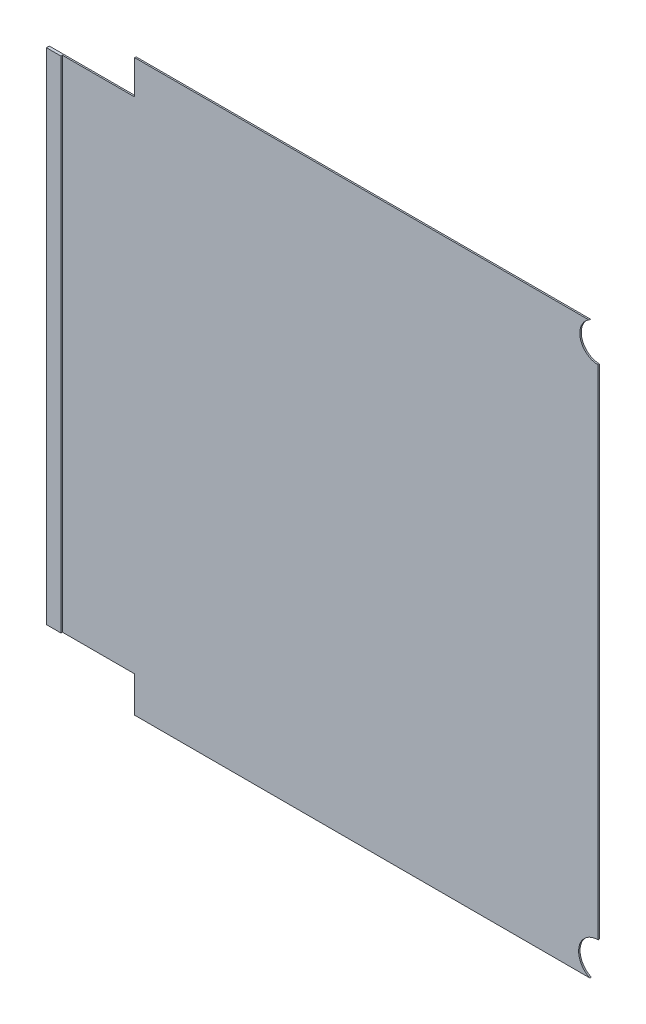
ISO-10303-21;
HEADER;
FILE_DESCRIPTION(('STEP AP214'),'2;1');
FILE_NAME('part.step','',(''),(''),'','','');
FILE_SCHEMA(('AUTOMOTIVE_DESIGN { 1 0 10303 214 1 1 1 1 }'));
ENDSEC;
DATA;
#1=APPLICATION_CONTEXT('core data for automotive mechanical design processes');
#2=APPLICATION_PROTOCOL_DEFINITION('international standard','automotive_design',2000,#1);
#3=PRODUCT_CONTEXT('',#1,'mechanical');
#4=PRODUCT('Part','Part','',(#3));
#5=PRODUCT_RELATED_PRODUCT_CATEGORY('part','',(#4));
#6=PRODUCT_DEFINITION_FORMATION('','',#4);
#7=PRODUCT_DEFINITION_CONTEXT('part definition',#1,'design');
#8=PRODUCT_DEFINITION('design','',#6,#7);
#9=PRODUCT_DEFINITION_SHAPE('','',#8);
#10=(LENGTH_UNIT() NAMED_UNIT(*) SI_UNIT(.MILLI.,.METRE.));
#11=(NAMED_UNIT(*) PLANE_ANGLE_UNIT() SI_UNIT($,.RADIAN.));
#12=(NAMED_UNIT(*) SI_UNIT($,.STERADIAN.) SOLID_ANGLE_UNIT());
#13=UNCERTAINTY_MEASURE_WITH_UNIT(LENGTH_MEASURE(1.E-05),#10,'distance_accuracy_value','');
#14=(GEOMETRIC_REPRESENTATION_CONTEXT(3) GLOBAL_UNCERTAINTY_ASSIGNED_CONTEXT((#13)) GLOBAL_UNIT_ASSIGNED_CONTEXT((#10,
#11,#12)) REPRESENTATION_CONTEXT('',''));
#15=CARTESIAN_POINT('',(0.,0.,0.));
#16=DIRECTION('',(0.,0.,1.));
#17=DIRECTION('',(1.,0.,0.));
#18=AXIS2_PLACEMENT_3D('',#15,#16,#17);
#19=CARTESIAN_POINT('',(-280.000000000001,184.999999999997,1.));
#20=DIRECTION('',(0.,0.,-1.));
#21=DIRECTION('',(-1.,0.,0.));
#22=AXIS2_PLACEMENT_3D('',#19,#20,#21);
#23=CYLINDRICAL_SURFACE('',#22,12.6657479077272);
#24=CARTESIAN_POINT('',(-280.000000000001,184.999999999997,0.));
#25=DIRECTION('',(0.,0.,-1.));
#26=DIRECTION('',(1.,0.,0.));
#27=AXIS2_PLACEMENT_3D('',#24,#25,#26);
#28=CIRCLE('',#27,12.6657479077272);
#29=CARTESIAN_POINT('',(-280.000000000001,172.334252092269,0.));
#30=VERTEX_POINT('',#29);
#31=CARTESIAN_POINT('',(-286.278628039789,196.000000000001,0.));
#32=VERTEX_POINT('',#31);
#33=EDGE_CURVE('E140',#30,#32,#28,.T.);
#34=ORIENTED_EDGE('',*,*,#33,.T.);
#35=DIRECTION('',(0.,0.,-1.));
#36=VECTOR('',#35,1.);
#37=CARTESIAN_POINT('',(-286.278628039789,196.000000000001,1.));
#38=LINE('',#37,#36);
#39=CARTESIAN_POINT('',(-286.278628039789,196.000000000001,1.));
#40=VERTEX_POINT('',#39);
#41=EDGE_CURVE('E11',#40,#32,#38,.T.);
#42=ORIENTED_EDGE('',*,*,#41,.F.);
#43=CARTESIAN_POINT('',(-280.000000000001,184.999999999997,1.));
#44=DIRECTION('',(0.,0.,-1.));
#45=DIRECTION('',(1.,0.,0.));
#46=AXIS2_PLACEMENT_3D('',#43,#44,#45);
#47=CIRCLE('',#46,12.6657479077272);
#48=CARTESIAN_POINT('',(-280.000000000001,172.334252092269,1.));
#49=VERTEX_POINT('',#48);
#50=EDGE_CURVE('E158',#49,#40,#47,.T.);
#51=ORIENTED_EDGE('',*,*,#50,.F.);
#52=DIRECTION('',(0.,0.,-1.));
#53=VECTOR('',#52,1.);
#54=CARTESIAN_POINT('',(-280.000000000001,172.334252092269,1.));
#55=LINE('',#54,#53);
#56=EDGE_CURVE('E136',#49,#30,#55,.T.);
#57=ORIENTED_EDGE('',*,*,#56,.T.);
#58=EDGE_LOOP('',(#34,#42,#51,#57));
#59=FACE_BOUND('',#58,.T.);
#60=ADVANCED_FACE('F38',(#59),#23,.F.);
#61=CARTESIAN_POINT('',(-286.278628039789,196.000000000001,1.));
#62=DIRECTION('',(0.,-1.,0.));
#63=DIRECTION('',(1.,0.,0.));
#64=AXIS2_PLACEMENT_3D('',#61,#62,#63);
#65=PLANE('',#64);
#66=DIRECTION('',(-1.,0.,0.));
#67=VECTOR('',#66,1.);
#68=CARTESIAN_POINT('',(-286.278628039789,196.000000000001,0.));
#69=LINE('',#68,#67);
#70=CARTESIAN_POINT('',(-599.96804262372,196.000000000001,0.));
#71=VERTEX_POINT('',#70);
#72=EDGE_CURVE('E143',#32,#71,#69,.T.);
#73=ORIENTED_EDGE('',*,*,#72,.T.);
#74=DIRECTION('',(0.,0.,-1.));
#75=VECTOR('',#74,1.);
#76=CARTESIAN_POINT('',(-599.96804262372,196.000000000001,1.));
#77=LINE('',#76,#75);
#78=CARTESIAN_POINT('',(-599.96804262372,196.000000000001,1.));
#79=VERTEX_POINT('',#78);
#80=EDGE_CURVE('E46',#79,#71,#77,.T.);
#81=ORIENTED_EDGE('',*,*,#80,.F.);
#82=DIRECTION('',(-1.,0.,0.));
#83=VECTOR('',#82,1.);
#84=CARTESIAN_POINT('',(-286.278628039789,196.000000000001,1.));
#85=LINE('',#84,#83);
#86=EDGE_CURVE('E98',#40,#79,#85,.T.);
#87=ORIENTED_EDGE('',*,*,#86,.F.);
#88=ORIENTED_EDGE('',*,*,#41,.T.);
#89=EDGE_LOOP('',(#73,#81,#87,#88));
#90=FACE_BOUND('',#89,.T.);
#91=ADVANCED_FACE('F244',(#90),#65,.F.);
#92=CARTESIAN_POINT('',(-599.96804262372,196.000000000001,1.));
#93=DIRECTION('',(1.,0.,0.));
#94=DIRECTION('',(0.,0.,-1.));
#95=AXIS2_PLACEMENT_3D('',#92,#93,#94);
#96=PLANE('',#95);
#97=DIRECTION('',(0.,-1.,0.));
#98=VECTOR('',#97,1.);
#99=CARTESIAN_POINT('',(-599.96804262372,196.000000000001,0.));
#100=LINE('',#99,#98);
#101=CARTESIAN_POINT('',(-599.96804262372,172.499999999993,0.));
#102=VERTEX_POINT('',#101);
#103=EDGE_CURVE('E146',#71,#102,#100,.T.);
#104=ORIENTED_EDGE('',*,*,#103,.T.);
#105=DIRECTION('',(0.,0.,-1.));
#106=VECTOR('',#105,1.);
#107=CARTESIAN_POINT('',(-599.96804262372,172.499999999993,1.));
#108=LINE('',#107,#106);
#109=CARTESIAN_POINT('',(-599.96804262372,172.499999999993,1.));
#110=VERTEX_POINT('',#109);
#111=EDGE_CURVE('E165',#110,#102,#108,.T.);
#112=ORIENTED_EDGE('',*,*,#111,.F.);
#113=DIRECTION('',(0.,-1.,0.));
#114=VECTOR('',#113,1.);
#115=CARTESIAN_POINT('',(-599.96804262372,196.000000000001,1.));
#116=LINE('',#115,#114);
#117=EDGE_CURVE('E173',#79,#110,#116,.T.);
#118=ORIENTED_EDGE('',*,*,#117,.F.);
#119=ORIENTED_EDGE('',*,*,#80,.T.);
#120=EDGE_LOOP('',(#104,#112,#118,#119));
#121=FACE_BOUND('',#120,.T.);
#122=ADVANCED_FACE('F171',(#121),#96,.F.);
#123=CARTESIAN_POINT('',(-649.96804262372,172.499999999995,1.));
#124=DIRECTION('',(0.,-1.,0.));
#125=DIRECTION('',(1.,0.,0.));
#126=AXIS2_PLACEMENT_3D('',#123,#124,#125);
#127=PLANE('',#126);
#128=DIRECTION('',(-1.,0.,0.));
#129=VECTOR('',#128,1.);
#130=CARTESIAN_POINT('',(-649.96804262372,172.499999999995,0.));
#131=LINE('',#130,#129);
#132=CARTESIAN_POINT('',(-659.96804262372,172.499999999995,0.));
#133=VERTEX_POINT('',#132);
#134=EDGE_CURVE('E148',#102,#133,#131,.T.);
#135=ORIENTED_EDGE('',*,*,#134,.T.);
#136=DIRECTION('',(0.,0.,-1.));
#137=VECTOR('',#136,1.);
#138=CARTESIAN_POINT('',(-659.96804262372,172.499999999995,2.));
#139=LINE('',#138,#137);
#140=CARTESIAN_POINT('',(-659.96804262372,172.499999999995,2.));
#141=VERTEX_POINT('',#140);
#142=EDGE_CURVE('E189',#141,#133,#139,.T.);
#143=ORIENTED_EDGE('',*,*,#142,.F.);
#144=DIRECTION('',(1.,0.,0.));
#145=VECTOR('',#144,1.);
#146=CARTESIAN_POINT('',(-649.96804262372,172.499999999995,2.));
#147=LINE('',#146,#145);
#148=CARTESIAN_POINT('',(-649.96804262372,172.499999999995,2.));
#149=VERTEX_POINT('',#148);
#150=EDGE_CURVE('E210',#141,#149,#147,.T.);
#151=ORIENTED_EDGE('',*,*,#150,.T.);
#152=DIRECTION('',(0.,0.,-1.));
#153=VECTOR('',#152,1.);
#154=CARTESIAN_POINT('',(-649.96804262372,172.499999999995,2.));
#155=LINE('',#154,#153);
#156=CARTESIAN_POINT('',(-649.96804262372,172.499999999995,1.));
#157=VERTEX_POINT('',#156);
#158=EDGE_CURVE('E144',#149,#157,#155,.T.);
#159=ORIENTED_EDGE('',*,*,#158,.T.);
#160=DIRECTION('',(-1.,0.,0.));
#161=VECTOR('',#160,1.);
#162=CARTESIAN_POINT('',(-649.96804262372,172.499999999995,1.));
#163=LINE('',#162,#161);
#164=EDGE_CURVE('E214',#110,#157,#163,.T.);
#165=ORIENTED_EDGE('',*,*,#164,.F.);
#166=ORIENTED_EDGE('',*,*,#111,.T.);
#167=EDGE_LOOP('',(#135,#143,#151,#159,#165,#166));
#168=FACE_BOUND('',#167,.T.);
#169=ADVANCED_FACE('F186',(#168),#127,.F.);
#170=CARTESIAN_POINT('',(-649.96804262372,-172.500000000004,1.));
#171=DIRECTION('',(0.,1.,0.));
#172=DIRECTION('',(-1.,0.,0.));
#173=AXIS2_PLACEMENT_3D('',#170,#171,#172);
#174=PLANE('',#173);
#175=DIRECTION('',(1.,0.,0.));
#176=VECTOR('',#175,1.);
#177=CARTESIAN_POINT('',(-649.96804262372,-172.500000000004,0.));
#178=LINE('',#177,#176);
#179=CARTESIAN_POINT('',(-659.96804262372,-172.500000000004,0.));
#180=VERTEX_POINT('',#179);
#181=CARTESIAN_POINT('',(-599.96804262372,-172.500000000002,0.));
#182=VERTEX_POINT('',#181);
#183=EDGE_CURVE('E151',#180,#182,#178,.T.);
#184=ORIENTED_EDGE('',*,*,#183,.T.);
#185=DIRECTION('',(0.,0.,-1.));
#186=VECTOR('',#185,1.);
#187=CARTESIAN_POINT('',(-599.96804262372,-172.500000000002,1.));
#188=LINE('',#187,#186);
#189=CARTESIAN_POINT('',(-599.96804262372,-172.500000000002,1.));
#190=VERTEX_POINT('',#189);
#191=EDGE_CURVE('E162',#190,#182,#188,.T.);
#192=ORIENTED_EDGE('',*,*,#191,.F.);
#193=DIRECTION('',(1.,0.,0.));
#194=VECTOR('',#193,1.);
#195=CARTESIAN_POINT('',(-649.96804262372,-172.500000000004,1.));
#196=LINE('',#195,#194);
#197=CARTESIAN_POINT('',(-649.96804262372,-172.500000000004,1.));
#198=VERTEX_POINT('',#197);
#199=EDGE_CURVE('E220',#198,#190,#196,.T.);
#200=ORIENTED_EDGE('',*,*,#199,.F.);
#201=DIRECTION('',(0.,0.,-1.));
#202=VECTOR('',#201,1.);
#203=CARTESIAN_POINT('',(-649.96804262372,-172.500000000004,2.));
#204=LINE('',#203,#202);
#205=CARTESIAN_POINT('',(-649.96804262372,-172.500000000004,2.));
#206=VERTEX_POINT('',#205);
#207=EDGE_CURVE('E205',#206,#198,#204,.T.);
#208=ORIENTED_EDGE('',*,*,#207,.F.);
#209=DIRECTION('',(-1.,0.,0.));
#210=VECTOR('',#209,1.);
#211=CARTESIAN_POINT('',(-649.96804262372,-172.500000000004,2.));
#212=LINE('',#211,#210);
#213=CARTESIAN_POINT('',(-659.96804262372,-172.500000000004,2.));
#214=VERTEX_POINT('',#213);
#215=EDGE_CURVE('E338',#206,#214,#212,.T.);
#216=ORIENTED_EDGE('',*,*,#215,.T.);
#217=DIRECTION('',(0.,0.,-1.));
#218=VECTOR('',#217,1.);
#219=CARTESIAN_POINT('',(-659.96804262372,-172.500000000004,2.));
#220=LINE('',#219,#218);
#221=EDGE_CURVE('E200',#214,#180,#220,.T.);
#222=ORIENTED_EDGE('',*,*,#221,.T.);
#223=EDGE_LOOP('',(#184,#192,#200,#208,#216,#222));
#224=FACE_BOUND('',#223,.T.);
#225=ADVANCED_FACE('F226',(#224),#174,.F.);
#226=CARTESIAN_POINT('',(-599.96804262372,-197.196347915136,1.));
#227=DIRECTION('',(1.,0.,0.));
#228=DIRECTION('',(0.,0.,-1.));
#229=AXIS2_PLACEMENT_3D('',#226,#227,#228);
#230=PLANE('',#229);
#231=DIRECTION('',(0.,-1.,0.));
#232=VECTOR('',#231,1.);
#233=CARTESIAN_POINT('',(-599.96804262372,-197.196347915136,0.));
#234=LINE('',#233,#232);
#235=CARTESIAN_POINT('',(-599.96804262372,-197.196347915136,0.));
#236=VERTEX_POINT('',#235);
#237=EDGE_CURVE('E153',#182,#236,#234,.T.);
#238=ORIENTED_EDGE('',*,*,#237,.T.);
#239=DIRECTION('',(0.,0.,-1.));
#240=VECTOR('',#239,1.);
#241=CARTESIAN_POINT('',(-599.96804262372,-197.196347915136,1.));
#242=LINE('',#241,#240);
#243=CARTESIAN_POINT('',(-599.96804262372,-197.196347915136,1.));
#244=VERTEX_POINT('',#243);
#245=EDGE_CURVE('E131',#244,#236,#242,.T.);
#246=ORIENTED_EDGE('',*,*,#245,.F.);
#247=DIRECTION('',(0.,-1.,0.));
#248=VECTOR('',#247,1.);
#249=CARTESIAN_POINT('',(-599.96804262372,-197.196347915136,1.));
#250=LINE('',#249,#248);
#251=EDGE_CURVE('E122',#190,#244,#250,.T.);
#252=ORIENTED_EDGE('',*,*,#251,.F.);
#253=ORIENTED_EDGE('',*,*,#191,.T.);
#254=EDGE_LOOP('',(#238,#246,#252,#253));
#255=FACE_BOUND('',#254,.T.);
#256=ADVANCED_FACE('F229',(#255),#230,.F.);
#257=CARTESIAN_POINT('',(-285.747034081971,-197.196347915136,1.));
#258=DIRECTION('',(0.,1.,0.));
#259=DIRECTION('',(0.,0.,1.));
#260=AXIS2_PLACEMENT_3D('',#257,#258,#259);
#261=PLANE('',#260);
#262=DIRECTION('',(1.,0.,0.));
#263=VECTOR('',#262,1.);
#264=CARTESIAN_POINT('',(-285.747034081971,-197.196347915136,0.));
#265=LINE('',#264,#263);
#266=CARTESIAN_POINT('',(-285.747034081971,-197.196347915136,0.));
#267=VERTEX_POINT('',#266);
#268=EDGE_CURVE('E130',#236,#267,#265,.T.);
#269=ORIENTED_EDGE('',*,*,#268,.T.);
#270=DIRECTION('',(0.,0.,-1.));
#271=VECTOR('',#270,1.);
#272=CARTESIAN_POINT('',(-285.747034081971,-197.196347915136,1.));
#273=LINE('',#272,#271);
#274=CARTESIAN_POINT('',(-285.747034081971,-197.196347915136,1.));
#275=VERTEX_POINT('',#274);
#276=EDGE_CURVE('E127',#275,#267,#273,.T.);
#277=ORIENTED_EDGE('',*,*,#276,.F.);
#278=DIRECTION('',(1.,0.,0.));
#279=VECTOR('',#278,1.);
#280=CARTESIAN_POINT('',(-285.747034081971,-197.196347915136,1.));
#281=LINE('',#280,#279);
#282=EDGE_CURVE('E116',#244,#275,#281,.T.);
#283=ORIENTED_EDGE('',*,*,#282,.F.);
#284=ORIENTED_EDGE('',*,*,#245,.T.);
#285=EDGE_LOOP('',(#269,#277,#283,#284));
#286=FACE_BOUND('',#285,.T.);
#287=ADVANCED_FACE('F128',(#286),#261,.F.);
#288=CARTESIAN_POINT('',(-279.999999999999,-185.000000000002,1.));
#289=DIRECTION('',(0.,0.,-1.));
#290=DIRECTION('',(-1.,0.,0.));
#291=AXIS2_PLACEMENT_3D('',#288,#289,#290);
#292=CYLINDRICAL_SURFACE('',#291,13.4825555146771);
#293=CARTESIAN_POINT('',(-279.999999999999,-185.000000000002,0.));
#294=DIRECTION('',(0.,0.,-1.));
#295=DIRECTION('',(1.,0.,0.));
#296=AXIS2_PLACEMENT_3D('',#293,#294,#295);
#297=CIRCLE('',#296,13.4825555146771);
#298=CARTESIAN_POINT('',(-280.000000000001,-171.517444485325,0.));
#299=VERTEX_POINT('',#298);
#300=EDGE_CURVE('E84',#267,#299,#297,.T.);
#301=ORIENTED_EDGE('',*,*,#300,.T.);
#302=DIRECTION('',(0.,0.,-1.));
#303=VECTOR('',#302,1.);
#304=CARTESIAN_POINT('',(-280.000000000001,-171.517444485325,1.));
#305=LINE('',#304,#303);
#306=CARTESIAN_POINT('',(-280.000000000001,-171.517444485325,1.));
#307=VERTEX_POINT('',#306);
#308=EDGE_CURVE('E132',#307,#299,#305,.T.);
#309=ORIENTED_EDGE('',*,*,#308,.F.);
#310=CARTESIAN_POINT('',(-279.999999999999,-185.000000000002,1.));
#311=DIRECTION('',(0.,0.,-1.));
#312=DIRECTION('',(1.,0.,0.));
#313=AXIS2_PLACEMENT_3D('',#310,#311,#312);
#314=CIRCLE('',#313,13.4825555146771);
#315=EDGE_CURVE('E120',#275,#307,#314,.T.);
#316=ORIENTED_EDGE('',*,*,#315,.F.);
#317=ORIENTED_EDGE('',*,*,#276,.T.);
#318=EDGE_LOOP('',(#301,#309,#316,#317));
#319=FACE_BOUND('',#318,.T.);
#320=ADVANCED_FACE('F134',(#319),#292,.F.);
#321=CARTESIAN_POINT('',(-280.000000000001,172.334252092269,1.));
#322=DIRECTION('',(-1.,0.,0.));
#323=DIRECTION('',(0.,0.,1.));
#324=AXIS2_PLACEMENT_3D('',#321,#322,#323);
#325=PLANE('',#324);
#326=DIRECTION('',(0.,1.,0.));
#327=VECTOR('',#326,1.);
#328=CARTESIAN_POINT('',(-280.000000000001,172.334252092269,0.));
#329=LINE('',#328,#327);
#330=EDGE_CURVE('E90',#299,#30,#329,.T.);
#331=ORIENTED_EDGE('',*,*,#330,.T.);
#332=ORIENTED_EDGE('',*,*,#56,.F.);
#333=DIRECTION('',(0.,1.,0.));
#334=VECTOR('',#333,1.);
#335=CARTESIAN_POINT('',(-280.000000000001,172.334252092269,1.));
#336=LINE('',#335,#334);
#337=EDGE_CURVE('E54',#307,#49,#336,.T.);
#338=ORIENTED_EDGE('',*,*,#337,.F.);
#339=ORIENTED_EDGE('',*,*,#308,.T.);
#340=EDGE_LOOP('',(#331,#332,#338,#339));
#341=FACE_BOUND('',#340,.T.);
#342=ADVANCED_FACE('F233',(#341),#325,.F.);
#343=CARTESIAN_POINT('',(-280.000000000001,184.999999999997,1.));
#344=DIRECTION('',(0.,0.,1.));
#345=DIRECTION('',(1.,0.,0.));
#346=AXIS2_PLACEMENT_3D('',#343,#344,#345);
#347=PLANE('',#346);
#348=ORIENTED_EDGE('',*,*,#50,.T.);
#349=ORIENTED_EDGE('',*,*,#86,.T.);
#350=ORIENTED_EDGE('',*,*,#117,.T.);
#351=ORIENTED_EDGE('',*,*,#164,.T.);
#352=DIRECTION('',(0.,-1.,0.));
#353=VECTOR('',#352,1.);
#354=CARTESIAN_POINT('',(-649.96804262372,172.499999999995,1.));
#355=LINE('',#354,#353);
#356=EDGE_CURVE('E217',#157,#198,#355,.T.);
#357=ORIENTED_EDGE('',*,*,#356,.T.);
#358=ORIENTED_EDGE('',*,*,#199,.T.);
#359=ORIENTED_EDGE('',*,*,#251,.T.);
#360=ORIENTED_EDGE('',*,*,#282,.T.);
#361=ORIENTED_EDGE('',*,*,#315,.T.);
#362=ORIENTED_EDGE('',*,*,#337,.T.);
#363=EDGE_LOOP('',(#348,#349,#350,#351,#357,#358,#359,#360,#361,#362));
#364=FACE_BOUND('',#363,.T.);
#365=ADVANCED_FACE('F118',(#364),#347,.T.);
#366=CARTESIAN_POINT('',(-280.000000000001,184.999999999997,0.));
#367=DIRECTION('',(0.,0.,1.));
#368=DIRECTION('',(1.,0.,0.));
#369=AXIS2_PLACEMENT_3D('',#366,#367,#368);
#370=PLANE('',#369);
#371=ORIENTED_EDGE('',*,*,#33,.F.);
#372=ORIENTED_EDGE('',*,*,#330,.F.);
#373=ORIENTED_EDGE('',*,*,#300,.F.);
#374=ORIENTED_EDGE('',*,*,#268,.F.);
#375=ORIENTED_EDGE('',*,*,#237,.F.);
#376=ORIENTED_EDGE('',*,*,#183,.F.);
#377=DIRECTION('',(0.,1.,0.));
#378=VECTOR('',#377,1.);
#379=CARTESIAN_POINT('',(-659.96804262372,172.499999999995,0.));
#380=LINE('',#379,#378);
#381=EDGE_CURVE('E182',#180,#133,#380,.T.);
#382=ORIENTED_EDGE('',*,*,#381,.T.);
#383=ORIENTED_EDGE('',*,*,#134,.F.);
#384=ORIENTED_EDGE('',*,*,#103,.F.);
#385=ORIENTED_EDGE('',*,*,#72,.F.);
#386=EDGE_LOOP('',(#371,#372,#373,#374,#375,#376,#382,#383,#384,#385));
#387=FACE_BOUND('',#386,.T.);
#388=ADVANCED_FACE('F177',(#387),#370,.F.);
#389=CARTESIAN_POINT('',(-649.96804262372,172.499999999995,2.));
#390=DIRECTION('',(1.,0.,0.));
#391=DIRECTION('',(0.,0.,-1.));
#392=AXIS2_PLACEMENT_3D('',#389,#390,#391);
#393=PLANE('',#392);
#394=ORIENTED_EDGE('',*,*,#356,.F.);
#395=ORIENTED_EDGE('',*,*,#158,.F.);
#396=DIRECTION('',(0.,-1.,0.));
#397=VECTOR('',#396,1.);
#398=CARTESIAN_POINT('',(-649.96804262372,172.499999999995,2.));
#399=LINE('',#398,#397);
#400=EDGE_CURVE('E336',#149,#206,#399,.T.);
#401=ORIENTED_EDGE('',*,*,#400,.T.);
#402=ORIENTED_EDGE('',*,*,#207,.T.);
#403=EDGE_LOOP('',(#394,#395,#401,#402));
#404=FACE_BOUND('',#403,.T.);
#405=ADVANCED_FACE('F302',(#404),#393,.T.);
#406=CARTESIAN_POINT('',(-659.96804262372,172.499999999995,2.));
#407=DIRECTION('',(-1.,0.,0.));
#408=DIRECTION('',(0.,0.,1.));
#409=AXIS2_PLACEMENT_3D('',#406,#407,#408);
#410=PLANE('',#409);
#411=ORIENTED_EDGE('',*,*,#381,.F.);
#412=ORIENTED_EDGE('',*,*,#221,.F.);
#413=DIRECTION('',(0.,1.,0.));
#414=VECTOR('',#413,1.);
#415=CARTESIAN_POINT('',(-659.96804262372,172.499999999995,2.));
#416=LINE('',#415,#414);
#417=EDGE_CURVE('E198',#214,#141,#416,.T.);
#418=ORIENTED_EDGE('',*,*,#417,.T.);
#419=ORIENTED_EDGE('',*,*,#142,.T.);
#420=EDGE_LOOP('',(#411,#412,#418,#419));
#421=FACE_BOUND('',#420,.T.);
#422=ADVANCED_FACE('F195',(#421),#410,.T.);
#423=CARTESIAN_POINT('',(0.,0.,2.));
#424=DIRECTION('',(0.,0.,-1.));
#425=DIRECTION('',(-1.,0.,0.));
#426=AXIS2_PLACEMENT_3D('',#423,#424,#425);
#427=PLANE('',#426);
#428=ORIENTED_EDGE('',*,*,#400,.F.);
#429=ORIENTED_EDGE('',*,*,#150,.F.);
#430=ORIENTED_EDGE('',*,*,#417,.F.);
#431=ORIENTED_EDGE('',*,*,#215,.F.);
#432=EDGE_LOOP('',(#428,#429,#430,#431));
#433=FACE_BOUND('',#432,.T.);
#434=ADVANCED_FACE('F319',(#433),#427,.F.);
#435=CLOSED_SHELL('',(#60,#91,#122,#169,#225,#256,#287,#320,#342,#365,#388,#405,#422,#434));
#436=MANIFOLD_SOLID_BREP('B2',#435);
#437=ADVANCED_BREP_SHAPE_REPRESENTATION('',(#18,#436),#14);
#438=SHAPE_DEFINITION_REPRESENTATION(#9,#437);
ENDSEC;
END-ISO-10303-21;
